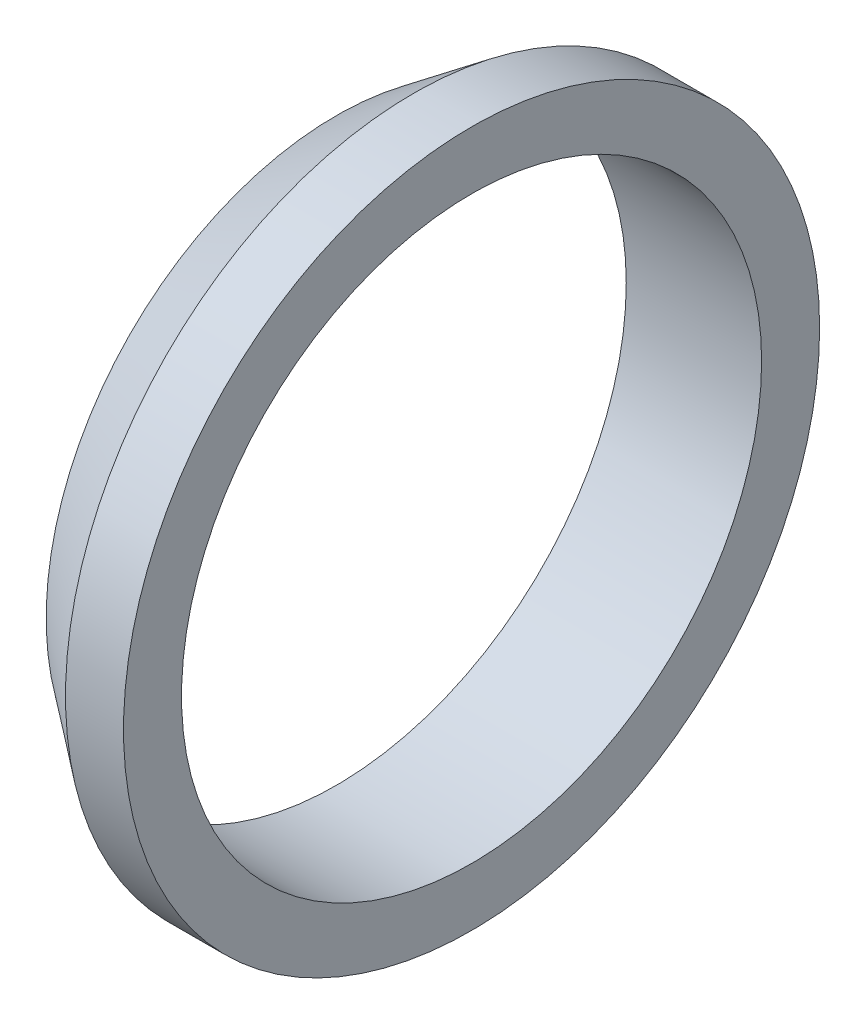
ISO-10303-21;
HEADER;
FILE_DESCRIPTION(('STEP AP214'),'2;1');
FILE_NAME('part.step','',(''),(''),'','','');
FILE_SCHEMA(('AUTOMOTIVE_DESIGN { 1 0 10303 214 1 1 1 1 }'));
ENDSEC;
DATA;
#1=APPLICATION_CONTEXT('core data for automotive mechanical design processes');
#2=APPLICATION_PROTOCOL_DEFINITION('international standard','automotive_design',2000,#1);
#3=PRODUCT_CONTEXT('',#1,'mechanical');
#4=PRODUCT('Part','Part','',(#3));
#5=PRODUCT_RELATED_PRODUCT_CATEGORY('part','',(#4));
#6=PRODUCT_DEFINITION_FORMATION('','',#4);
#7=PRODUCT_DEFINITION_CONTEXT('part definition',#1,'design');
#8=PRODUCT_DEFINITION('design','',#6,#7);
#9=PRODUCT_DEFINITION_SHAPE('','',#8);
#10=(LENGTH_UNIT() NAMED_UNIT(*) SI_UNIT(.MILLI.,.METRE.));
#11=(NAMED_UNIT(*) PLANE_ANGLE_UNIT() SI_UNIT($,.RADIAN.));
#12=(NAMED_UNIT(*) SI_UNIT($,.STERADIAN.) SOLID_ANGLE_UNIT());
#13=UNCERTAINTY_MEASURE_WITH_UNIT(LENGTH_MEASURE(1.E-05),#10,'distance_accuracy_value','');
#14=(GEOMETRIC_REPRESENTATION_CONTEXT(3) GLOBAL_UNCERTAINTY_ASSIGNED_CONTEXT((#13)) GLOBAL_UNIT_ASSIGNED_CONTEXT((#10,
#11,#12)) REPRESENTATION_CONTEXT('',''));
#15=CARTESIAN_POINT('',(0.,0.,0.));
#16=DIRECTION('',(0.,0.,1.));
#17=DIRECTION('',(1.,0.,0.));
#18=AXIS2_PLACEMENT_3D('',#15,#16,#17);
#19=CARTESIAN_POINT('',(0.,0.,0.));
#20=DIRECTION('',(1.,0.,0.));
#21=DIRECTION('',(0.,0.,-1.));
#22=AXIS2_PLACEMENT_3D('',#19,#20,#21);
#23=CYLINDRICAL_SURFACE('',#22,18.);
#24=CARTESIAN_POINT('',(-3.,0.,0.));
#25=DIRECTION('',(1.,0.,0.));
#26=DIRECTION('',(0.,0.,-1.));
#27=AXIS2_PLACEMENT_3D('',#24,#25,#26);
#28=CIRCLE('',#27,18.);
#29=CARTESIAN_POINT('',(-3.,0.,-18.));
#30=VERTEX_POINT('',#29);
#31=EDGE_CURVE('E28',#30,#30,#28,.F.);
#32=ORIENTED_EDGE('',*,*,#31,.F.);
#33=EDGE_LOOP('',(#32));
#34=FACE_BOUND('',#33,.T.);
#35=CARTESIAN_POINT('',(0.,0.,0.));
#36=DIRECTION('',(1.,0.,0.));
#37=DIRECTION('',(0.,0.,-1.));
#38=AXIS2_PLACEMENT_3D('',#35,#36,#37);
#39=CIRCLE('',#38,18.);
#40=CARTESIAN_POINT('',(0.,0.,-18.));
#41=VERTEX_POINT('',#40);
#42=EDGE_CURVE('E19',#41,#41,#39,.T.);
#43=ORIENTED_EDGE('',*,*,#42,.F.);
#44=EDGE_LOOP('',(#43));
#45=FACE_BOUND('',#44,.T.);
#46=ADVANCED_FACE('F16',(#34,#45),#23,.T.);
#47=CARTESIAN_POINT('',(0.,15.,0.));
#48=DIRECTION('',(1.,0.,0.));
#49=DIRECTION('',(0.,0.,-1.));
#50=AXIS2_PLACEMENT_3D('',#47,#48,#49);
#51=PLANE('',#50);
#52=CARTESIAN_POINT('',(0.,0.,0.));
#53=DIRECTION('',(1.,0.,0.));
#54=DIRECTION('',(0.,0.,-1.));
#55=AXIS2_PLACEMENT_3D('',#52,#53,#54);
#56=CIRCLE('',#55,15.);
#57=CARTESIAN_POINT('',(0.,0.,-15.));
#58=VERTEX_POINT('',#57);
#59=EDGE_CURVE('E23',#58,#58,#56,.F.);
#60=ORIENTED_EDGE('',*,*,#59,.T.);
#61=EDGE_LOOP('',(#60));
#62=FACE_BOUND('',#61,.T.);
#63=ORIENTED_EDGE('',*,*,#42,.T.);
#64=EDGE_LOOP('',(#63));
#65=FACE_BOUND('',#64,.T.);
#66=ADVANCED_FACE('F36',(#62,#65),#51,.T.);
#67=CARTESIAN_POINT('',(-3.,0.,0.));
#68=DIRECTION('',(1.,0.,0.));
#69=DIRECTION('',(0.,1.,0.));
#70=AXIS2_PLACEMENT_3D('',#67,#68,#69);
#71=CONICAL_SURFACE('',#70,18.,0.643501108793285);
#72=CARTESIAN_POINT('',(-7.,0.,0.));
#73=DIRECTION('',(1.,0.,0.));
#74=DIRECTION('',(0.,0.,-1.));
#75=AXIS2_PLACEMENT_3D('',#72,#73,#74);
#76=CIRCLE('',#75,15.);
#77=CARTESIAN_POINT('',(-7.,0.,-15.));
#78=VERTEX_POINT('',#77);
#79=EDGE_CURVE('E10',#78,#78,#76,.T.);
#80=ORIENTED_EDGE('',*,*,#79,.T.);
#81=EDGE_LOOP('',(#80));
#82=FACE_BOUND('',#81,.T.);
#83=ORIENTED_EDGE('',*,*,#31,.T.);
#84=EDGE_LOOP('',(#83));
#85=FACE_BOUND('',#84,.T.);
#86=ADVANCED_FACE('F43',(#82,#85),#71,.T.);
#87=CARTESIAN_POINT('',(0.,0.,0.));
#88=DIRECTION('',(1.,0.,0.));
#89=DIRECTION('',(0.,0.,-1.));
#90=AXIS2_PLACEMENT_3D('',#87,#88,#89);
#91=CYLINDRICAL_SURFACE('',#90,15.);
#92=ORIENTED_EDGE('',*,*,#59,.F.);
#93=EDGE_LOOP('',(#92));
#94=FACE_BOUND('',#93,.T.);
#95=ORIENTED_EDGE('',*,*,#79,.F.);
#96=EDGE_LOOP('',(#95));
#97=FACE_BOUND('',#96,.T.);
#98=ADVANCED_FACE('F45',(#94,#97),#91,.F.);
#99=CLOSED_SHELL('',(#46,#66,#86,#98));
#100=MANIFOLD_SOLID_BREP('B1',#99);
#101=ADVANCED_BREP_SHAPE_REPRESENTATION('',(#18,#100),#14);
#102=SHAPE_DEFINITION_REPRESENTATION(#9,#101);
ENDSEC;
END-ISO-10303-21;
